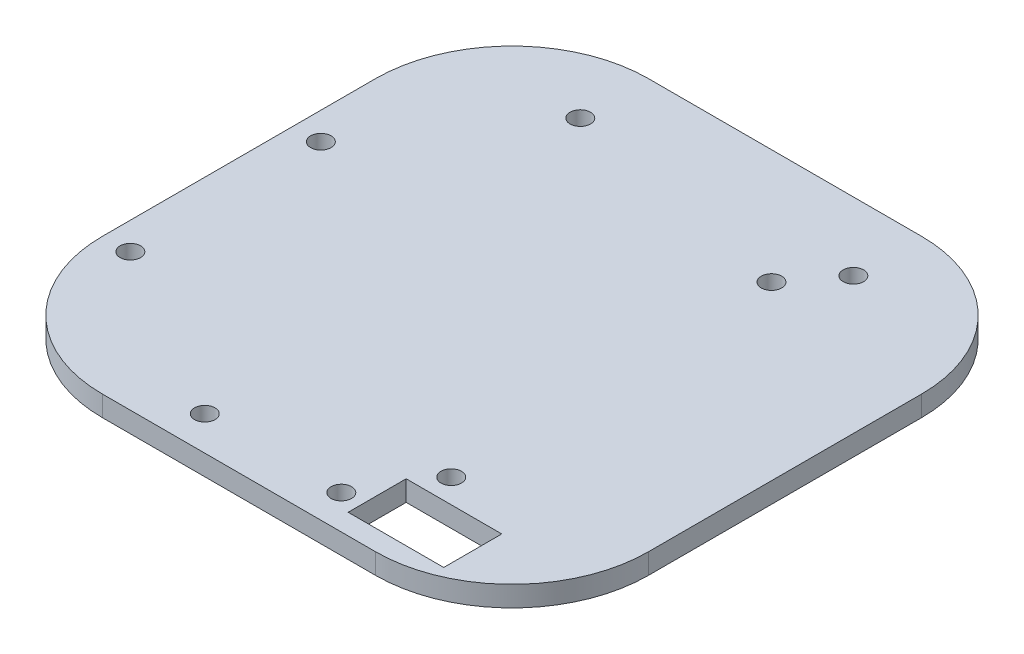
ISO-10303-21;
HEADER;
FILE_DESCRIPTION(('STEP AP214'),'2;1');
FILE_NAME('part.step','',(''),(''),'','','');
FILE_SCHEMA(('AUTOMOTIVE_DESIGN { 1 0 10303 214 1 1 1 1 }'));
ENDSEC;
DATA;
#1=APPLICATION_CONTEXT('core data for automotive mechanical design processes');
#2=APPLICATION_PROTOCOL_DEFINITION('international standard','automotive_design',2000,#1);
#3=PRODUCT_CONTEXT('',#1,'mechanical');
#4=PRODUCT('Part','Part','',(#3));
#5=PRODUCT_RELATED_PRODUCT_CATEGORY('part','',(#4));
#6=PRODUCT_DEFINITION_FORMATION('','',#4);
#7=PRODUCT_DEFINITION_CONTEXT('part definition',#1,'design');
#8=PRODUCT_DEFINITION('design','',#6,#7);
#9=PRODUCT_DEFINITION_SHAPE('','',#8);
#10=(LENGTH_UNIT() NAMED_UNIT(*) SI_UNIT(.MILLI.,.METRE.));
#11=(NAMED_UNIT(*) PLANE_ANGLE_UNIT() SI_UNIT($,.RADIAN.));
#12=(NAMED_UNIT(*) SI_UNIT($,.STERADIAN.) SOLID_ANGLE_UNIT());
#13=UNCERTAINTY_MEASURE_WITH_UNIT(LENGTH_MEASURE(1.E-05),#10,'distance_accuracy_value','');
#14=(GEOMETRIC_REPRESENTATION_CONTEXT(3) GLOBAL_UNCERTAINTY_ASSIGNED_CONTEXT((#13)) GLOBAL_UNIT_ASSIGNED_CONTEXT((#10,
#11,#12)) REPRESENTATION_CONTEXT('',''));
#15=CARTESIAN_POINT('',(0.,0.,0.));
#16=DIRECTION('',(0.,0.,1.));
#17=DIRECTION('',(1.,0.,0.));
#18=AXIS2_PLACEMENT_3D('',#15,#16,#17);
#19=CARTESIAN_POINT('',(20.,3.,-20.));
#20=DIRECTION('',(0.,-1.,0.));
#21=DIRECTION('',(0.,0.,-1.));
#22=AXIS2_PLACEMENT_3D('',#19,#20,#21);
#23=CYLINDRICAL_SURFACE('',#22,20.);
#24=DIRECTION('',(0.,-1.,0.));
#25=VECTOR('',#24,1.);
#26=CARTESIAN_POINT('',(20.,3.,0.));
#27=LINE('',#26,#25);
#28=CARTESIAN_POINT('',(20.,3.,0.));
#29=VERTEX_POINT('',#28);
#30=CARTESIAN_POINT('',(20.,0.,0.));
#31=VERTEX_POINT('',#30);
#32=EDGE_CURVE('E241',#29,#31,#27,.T.);
#33=ORIENTED_EDGE('',*,*,#32,.F.);
#34=CARTESIAN_POINT('',(20.,3.,-20.));
#35=DIRECTION('',(0.,-1.,0.));
#36=DIRECTION('',(0.,0.,-1.));
#37=AXIS2_PLACEMENT_3D('',#34,#35,#36);
#38=CIRCLE('',#37,20.);
#39=CARTESIAN_POINT('',(0.,3.,-20.));
#40=VERTEX_POINT('',#39);
#41=EDGE_CURVE('E247',#40,#29,#38,.F.);
#42=ORIENTED_EDGE('',*,*,#41,.F.);
#43=DIRECTION('',(0.,-1.,0.));
#44=VECTOR('',#43,1.);
#45=CARTESIAN_POINT('',(0.,3.,-20.));
#46=LINE('',#45,#44);
#47=CARTESIAN_POINT('',(0.,0.,-20.));
#48=VERTEX_POINT('',#47);
#49=EDGE_CURVE('E244',#48,#40,#46,.F.);
#50=ORIENTED_EDGE('',*,*,#49,.F.);
#51=CARTESIAN_POINT('',(20.,0.,-20.));
#52=DIRECTION('',(0.,-1.,0.));
#53=DIRECTION('',(0.,0.,-1.));
#54=AXIS2_PLACEMENT_3D('',#51,#52,#53);
#55=CIRCLE('',#54,20.);
#56=EDGE_CURVE('E249',#31,#48,#55,.T.);
#57=ORIENTED_EDGE('',*,*,#56,.F.);
#58=EDGE_LOOP('',(#33,#42,#50,#57));
#59=FACE_BOUND('',#58,.T.);
#60=ADVANCED_FACE('F35',(#59),#23,.T.);
#61=CARTESIAN_POINT('',(60.,3.,-20.));
#62=DIRECTION('',(0.,-1.,0.));
#63=DIRECTION('',(0.,0.,-1.));
#64=AXIS2_PLACEMENT_3D('',#61,#62,#63);
#65=CYLINDRICAL_SURFACE('',#64,20.);
#66=DIRECTION('',(0.,-1.,0.));
#67=VECTOR('',#66,1.);
#68=CARTESIAN_POINT('',(80.,3.,-20.));
#69=LINE('',#68,#67);
#70=CARTESIAN_POINT('',(80.,3.,-20.));
#71=VERTEX_POINT('',#70);
#72=CARTESIAN_POINT('',(80.,0.,-20.));
#73=VERTEX_POINT('',#72);
#74=EDGE_CURVE('E230',#71,#73,#69,.T.);
#75=ORIENTED_EDGE('',*,*,#74,.F.);
#76=CARTESIAN_POINT('',(60.,3.,-20.));
#77=DIRECTION('',(0.,-1.,0.));
#78=DIRECTION('',(0.,0.,-1.));
#79=AXIS2_PLACEMENT_3D('',#76,#77,#78);
#80=CIRCLE('',#79,20.);
#81=CARTESIAN_POINT('',(60.,3.,0.));
#82=VERTEX_POINT('',#81);
#83=EDGE_CURVE('E236',#82,#71,#80,.F.);
#84=ORIENTED_EDGE('',*,*,#83,.F.);
#85=DIRECTION('',(0.,-1.,0.));
#86=VECTOR('',#85,1.);
#87=CARTESIAN_POINT('',(60.,3.,0.));
#88=LINE('',#87,#86);
#89=CARTESIAN_POINT('',(60.,0.,0.));
#90=VERTEX_POINT('',#89);
#91=EDGE_CURVE('E233',#90,#82,#88,.F.);
#92=ORIENTED_EDGE('',*,*,#91,.F.);
#93=CARTESIAN_POINT('',(60.,0.,-20.));
#94=DIRECTION('',(0.,-1.,0.));
#95=DIRECTION('',(0.,0.,-1.));
#96=AXIS2_PLACEMENT_3D('',#93,#94,#95);
#97=CIRCLE('',#96,20.);
#98=EDGE_CURVE('E238',#73,#90,#97,.T.);
#99=ORIENTED_EDGE('',*,*,#98,.F.);
#100=EDGE_LOOP('',(#75,#84,#92,#99));
#101=FACE_BOUND('',#100,.T.);
#102=ADVANCED_FACE('F283',(#101),#65,.T.);
#103=CARTESIAN_POINT('',(60.,3.,-60.));
#104=DIRECTION('',(0.,1.,0.));
#105=DIRECTION('',(0.,0.,1.));
#106=AXIS2_PLACEMENT_3D('',#103,#104,#105);
#107=CYLINDRICAL_SURFACE('',#106,20.);
#108=DIRECTION('',(0.,1.,0.));
#109=VECTOR('',#108,1.);
#110=CARTESIAN_POINT('',(80.,3.,-60.));
#111=LINE('',#110,#109);
#112=CARTESIAN_POINT('',(80.,0.,-60.));
#113=VERTEX_POINT('',#112);
#114=CARTESIAN_POINT('',(80.,3.,-60.));
#115=VERTEX_POINT('',#114);
#116=EDGE_CURVE('E219',#113,#115,#111,.T.);
#117=ORIENTED_EDGE('',*,*,#116,.F.);
#118=CARTESIAN_POINT('',(60.,0.,-60.));
#119=DIRECTION('',(0.,-1.,0.));
#120=DIRECTION('',(0.,0.,-1.));
#121=AXIS2_PLACEMENT_3D('',#118,#119,#120);
#122=CIRCLE('',#121,20.);
#123=CARTESIAN_POINT('',(60.,0.,-80.));
#124=VERTEX_POINT('',#123);
#125=EDGE_CURVE('E225',#124,#113,#122,.T.);
#126=ORIENTED_EDGE('',*,*,#125,.F.);
#127=DIRECTION('',(0.,1.,0.));
#128=VECTOR('',#127,1.);
#129=CARTESIAN_POINT('',(60.,3.,-80.));
#130=LINE('',#129,#128);
#131=CARTESIAN_POINT('',(60.,3.,-80.));
#132=VERTEX_POINT('',#131);
#133=EDGE_CURVE('E222',#132,#124,#130,.F.);
#134=ORIENTED_EDGE('',*,*,#133,.F.);
#135=CARTESIAN_POINT('',(60.,3.,-60.));
#136=DIRECTION('',(0.,-1.,0.));
#137=DIRECTION('',(0.,0.,-1.));
#138=AXIS2_PLACEMENT_3D('',#135,#136,#137);
#139=CIRCLE('',#138,20.);
#140=EDGE_CURVE('E228',#115,#132,#139,.F.);
#141=ORIENTED_EDGE('',*,*,#140,.F.);
#142=EDGE_LOOP('',(#117,#126,#134,#141));
#143=FACE_BOUND('',#142,.T.);
#144=ADVANCED_FACE('F288',(#143),#107,.T.);
#145=CARTESIAN_POINT('',(20.,3.,-60.));
#146=DIRECTION('',(0.,-1.,0.));
#147=DIRECTION('',(0.,0.,-1.));
#148=AXIS2_PLACEMENT_3D('',#145,#146,#147);
#149=CYLINDRICAL_SURFACE('',#148,20.);
#150=DIRECTION('',(0.,-1.,0.));
#151=VECTOR('',#150,1.);
#152=CARTESIAN_POINT('',(0.,3.,-60.));
#153=LINE('',#152,#151);
#154=CARTESIAN_POINT('',(0.,3.,-60.));
#155=VERTEX_POINT('',#154);
#156=CARTESIAN_POINT('',(0.,0.,-60.));
#157=VERTEX_POINT('',#156);
#158=EDGE_CURVE('E201',#155,#157,#153,.T.);
#159=ORIENTED_EDGE('',*,*,#158,.F.);
#160=CARTESIAN_POINT('',(20.,3.,-60.));
#161=DIRECTION('',(0.,-1.,0.));
#162=DIRECTION('',(0.,0.,-1.));
#163=AXIS2_PLACEMENT_3D('',#160,#161,#162);
#164=CIRCLE('',#163,20.);
#165=CARTESIAN_POINT('',(20.,3.,-80.));
#166=VERTEX_POINT('',#165);
#167=EDGE_CURVE('E214',#166,#155,#164,.F.);
#168=ORIENTED_EDGE('',*,*,#167,.F.);
#169=DIRECTION('',(0.,-1.,0.));
#170=VECTOR('',#169,1.);
#171=CARTESIAN_POINT('',(20.,3.,-80.));
#172=LINE('',#171,#170);
#173=CARTESIAN_POINT('',(20.,0.,-80.));
#174=VERTEX_POINT('',#173);
#175=EDGE_CURVE('E211',#174,#166,#172,.F.);
#176=ORIENTED_EDGE('',*,*,#175,.F.);
#177=CARTESIAN_POINT('',(20.,0.,-60.));
#178=DIRECTION('',(0.,-1.,0.));
#179=DIRECTION('',(0.,0.,-1.));
#180=AXIS2_PLACEMENT_3D('',#177,#178,#179);
#181=CIRCLE('',#180,20.);
#182=EDGE_CURVE('E216',#157,#174,#181,.T.);
#183=ORIENTED_EDGE('',*,*,#182,.F.);
#184=EDGE_LOOP('',(#159,#168,#176,#183));
#185=FACE_BOUND('',#184,.T.);
#186=ADVANCED_FACE('F316',(#185),#149,.T.);
#187=CARTESIAN_POINT('',(0.,3.,0.));
#188=DIRECTION('',(1.,0.,0.));
#189=DIRECTION('',(0.,0.,-1.));
#190=AXIS2_PLACEMENT_3D('',#187,#188,#189);
#191=PLANE('',#190);
#192=DIRECTION('',(0.,0.,1.));
#193=VECTOR('',#192,1.);
#194=CARTESIAN_POINT('',(0.,0.,0.));
#195=LINE('',#194,#193);
#196=EDGE_CURVE('E188',#157,#48,#195,.T.);
#197=ORIENTED_EDGE('',*,*,#196,.T.);
#198=ORIENTED_EDGE('',*,*,#49,.T.);
#199=DIRECTION('',(0.,0.,1.));
#200=VECTOR('',#199,1.);
#201=CARTESIAN_POINT('',(0.,3.,0.));
#202=LINE('',#201,#200);
#203=EDGE_CURVE('E191',#155,#40,#202,.T.);
#204=ORIENTED_EDGE('',*,*,#203,.F.);
#205=ORIENTED_EDGE('',*,*,#158,.T.);
#206=EDGE_LOOP('',(#197,#198,#204,#205));
#207=FACE_BOUND('',#206,.T.);
#208=ADVANCED_FACE('F320',(#207),#191,.F.);
#209=CARTESIAN_POINT('',(0.,3.,0.));
#210=DIRECTION('',(0.,0.,-1.));
#211=DIRECTION('',(-1.,0.,0.));
#212=AXIS2_PLACEMENT_3D('',#209,#210,#211);
#213=PLANE('',#212);
#214=DIRECTION('',(1.,0.,0.));
#215=VECTOR('',#214,1.);
#216=CARTESIAN_POINT('',(0.,3.,0.));
#217=LINE('',#216,#215);
#218=EDGE_CURVE('E194',#29,#82,#217,.T.);
#219=ORIENTED_EDGE('',*,*,#218,.F.);
#220=ORIENTED_EDGE('',*,*,#32,.T.);
#221=DIRECTION('',(1.,0.,0.));
#222=VECTOR('',#221,1.);
#223=CARTESIAN_POINT('',(0.,0.,0.));
#224=LINE('',#223,#222);
#225=EDGE_CURVE('E204',#31,#90,#224,.T.);
#226=ORIENTED_EDGE('',*,*,#225,.T.);
#227=ORIENTED_EDGE('',*,*,#91,.T.);
#228=EDGE_LOOP('',(#219,#220,#226,#227));
#229=FACE_BOUND('',#228,.T.);
#230=ADVANCED_FACE('F295',(#229),#213,.F.);
#231=CARTESIAN_POINT('',(80.,3.,0.));
#232=DIRECTION('',(-1.,0.,0.));
#233=DIRECTION('',(0.,0.,1.));
#234=AXIS2_PLACEMENT_3D('',#231,#232,#233);
#235=PLANE('',#234);
#236=DIRECTION('',(0.,0.,-1.));
#237=VECTOR('',#236,1.);
#238=CARTESIAN_POINT('',(80.,3.,0.));
#239=LINE('',#238,#237);
#240=EDGE_CURVE('E197',#71,#115,#239,.T.);
#241=ORIENTED_EDGE('',*,*,#240,.F.);
#242=ORIENTED_EDGE('',*,*,#74,.T.);
#243=DIRECTION('',(0.,0.,-1.));
#244=VECTOR('',#243,1.);
#245=CARTESIAN_POINT('',(80.,0.,0.));
#246=LINE('',#245,#244);
#247=EDGE_CURVE('E206',#73,#113,#246,.T.);
#248=ORIENTED_EDGE('',*,*,#247,.T.);
#249=ORIENTED_EDGE('',*,*,#116,.T.);
#250=EDGE_LOOP('',(#241,#242,#248,#249));
#251=FACE_BOUND('',#250,.T.);
#252=ADVANCED_FACE('F303',(#251),#235,.F.);
#253=CARTESIAN_POINT('',(0.,3.,-80.));
#254=DIRECTION('',(0.,0.,1.));
#255=DIRECTION('',(1.,0.,0.));
#256=AXIS2_PLACEMENT_3D('',#253,#254,#255);
#257=PLANE('',#256);
#258=DIRECTION('',(-1.,0.,0.));
#259=VECTOR('',#258,1.);
#260=CARTESIAN_POINT('',(0.,3.,-80.));
#261=LINE('',#260,#259);
#262=EDGE_CURVE('E199',#132,#166,#261,.T.);
#263=ORIENTED_EDGE('',*,*,#262,.F.);
#264=ORIENTED_EDGE('',*,*,#133,.T.);
#265=DIRECTION('',(-1.,0.,0.));
#266=VECTOR('',#265,1.);
#267=CARTESIAN_POINT('',(0.,0.,-80.));
#268=LINE('',#267,#266);
#269=EDGE_CURVE('E195',#124,#174,#268,.T.);
#270=ORIENTED_EDGE('',*,*,#269,.T.);
#271=ORIENTED_EDGE('',*,*,#175,.T.);
#272=EDGE_LOOP('',(#263,#264,#270,#271));
#273=FACE_BOUND('',#272,.T.);
#274=ADVANCED_FACE('F311',(#273),#257,.F.);
#275=CARTESIAN_POINT('',(0.,3.,0.));
#276=DIRECTION('',(0.,-1.,0.));
#277=DIRECTION('',(0.,0.,-1.));
#278=AXIS2_PLACEMENT_3D('',#275,#276,#277);
#279=PLANE('',#278);
#280=DIRECTION('',(1.,0.,0.));
#281=VECTOR('',#280,1.);
#282=CARTESIAN_POINT('',(53.,3.,-3.));
#283=LINE('',#282,#281);
#284=CARTESIAN_POINT('',(53.,3.,-3.));
#285=VERTEX_POINT('',#284);
#286=CARTESIAN_POINT('',(67.,3.,-3.));
#287=VERTEX_POINT('',#286);
#288=EDGE_CURVE('E134',#285,#287,#283,.T.);
#289=ORIENTED_EDGE('',*,*,#288,.F.);
#290=DIRECTION('',(0.,0.,1.));
#291=VECTOR('',#290,1.);
#292=CARTESIAN_POINT('',(53.,3.,-11.5));
#293=LINE('',#292,#291);
#294=CARTESIAN_POINT('',(53.,3.,-11.5));
#295=VERTEX_POINT('',#294);
#296=EDGE_CURVE('E49',#295,#285,#293,.T.);
#297=ORIENTED_EDGE('',*,*,#296,.F.);
#298=DIRECTION('',(-1.,0.,0.));
#299=VECTOR('',#298,1.);
#300=CARTESIAN_POINT('',(53.,3.,-11.5));
#301=LINE('',#300,#299);
#302=CARTESIAN_POINT('',(67.,3.,-11.5));
#303=VERTEX_POINT('',#302);
#304=EDGE_CURVE('E141',#303,#295,#301,.T.);
#305=ORIENTED_EDGE('',*,*,#304,.F.);
#306=DIRECTION('',(0.,0.,-1.));
#307=VECTOR('',#306,1.);
#308=CARTESIAN_POINT('',(67.,3.,-11.5));
#309=LINE('',#308,#307);
#310=EDGE_CURVE('E125',#287,#303,#309,.T.);
#311=ORIENTED_EDGE('',*,*,#310,.F.);
#312=EDGE_LOOP('',(#289,#297,#305,#311));
#313=FACE_BOUND('',#312,.T.);
#314=CARTESIAN_POINT('',(56.1,3.,-15.));
#315=DIRECTION('',(0.,1.,0.));
#316=DIRECTION('',(0.,0.,1.));
#317=AXIS2_PLACEMENT_3D('',#314,#315,#316);
#318=CIRCLE('',#317,1.5);
#319=CARTESIAN_POINT('',(56.1,3.,-13.5));
#320=VERTEX_POINT('',#319);
#321=EDGE_CURVE('E148',#320,#320,#318,.T.);
#322=ORIENTED_EDGE('',*,*,#321,.F.);
#323=EDGE_LOOP('',(#322));
#324=FACE_BOUND('',#323,.T.);
#325=CARTESIAN_POINT('',(54.8,3.,-63.2));
#326=DIRECTION('',(0.,1.,0.));
#327=DIRECTION('',(0.,0.,1.));
#328=AXIS2_PLACEMENT_3D('',#325,#326,#327);
#329=CIRCLE('',#328,1.5);
#330=CARTESIAN_POINT('',(54.8,3.,-61.7));
#331=VERTEX_POINT('',#330);
#332=EDGE_CURVE('E154',#331,#331,#329,.T.);
#333=ORIENTED_EDGE('',*,*,#332,.F.);
#334=EDGE_LOOP('',(#333));
#335=FACE_BOUND('',#334,.T.);
#336=CARTESIAN_POINT('',(4.,3.,-48.));
#337=DIRECTION('',(0.,1.,0.));
#338=DIRECTION('',(0.,0.,1.));
#339=AXIS2_PLACEMENT_3D('',#336,#337,#338);
#340=CIRCLE('',#339,1.5);
#341=CARTESIAN_POINT('',(4.,3.,-46.5));
#342=VERTEX_POINT('',#341);
#343=EDGE_CURVE('E158',#342,#342,#340,.T.);
#344=ORIENTED_EDGE('',*,*,#343,.F.);
#345=EDGE_LOOP('',(#344));
#346=FACE_BOUND('',#345,.T.);
#347=CARTESIAN_POINT('',(4.,3.,-20.1));
#348=DIRECTION('',(0.,1.,0.));
#349=DIRECTION('',(0.,0.,1.));
#350=AXIS2_PLACEMENT_3D('',#347,#348,#349);
#351=CIRCLE('',#350,1.5);
#352=CARTESIAN_POINT('',(4.,3.,-18.6));
#353=VERTEX_POINT('',#352);
#354=EDGE_CURVE('E162',#353,#353,#351,.T.);
#355=ORIENTED_EDGE('',*,*,#354,.F.);
#356=EDGE_LOOP('',(#355));
#357=FACE_BOUND('',#356,.T.);
#358=CARTESIAN_POINT('',(60.,3.,-70.));
#359=DIRECTION('',(0.,1.,0.));
#360=DIRECTION('',(0.,0.,1.));
#361=AXIS2_PLACEMENT_3D('',#358,#359,#360);
#362=CIRCLE('',#361,1.5);
#363=CARTESIAN_POINT('',(60.,3.,-68.5));
#364=VERTEX_POINT('',#363);
#365=EDGE_CURVE('E170',#364,#364,#362,.T.);
#366=ORIENTED_EDGE('',*,*,#365,.F.);
#367=EDGE_LOOP('',(#366));
#368=FACE_BOUND('',#367,.T.);
#369=CARTESIAN_POINT('',(20.,3.,-70.));
#370=DIRECTION('',(0.,1.,0.));
#371=DIRECTION('',(0.,0.,1.));
#372=AXIS2_PLACEMENT_3D('',#369,#370,#371);
#373=CIRCLE('',#372,1.5);
#374=CARTESIAN_POINT('',(20.,3.,-68.5));
#375=VERTEX_POINT('',#374);
#376=EDGE_CURVE('E169',#375,#375,#373,.T.);
#377=ORIENTED_EDGE('',*,*,#376,.F.);
#378=EDGE_LOOP('',(#377));
#379=FACE_BOUND('',#378,.T.);
#380=CARTESIAN_POINT('',(50.,3.,-5.));
#381=DIRECTION('',(0.,1.,0.));
#382=DIRECTION('',(0.,0.,1.));
#383=AXIS2_PLACEMENT_3D('',#380,#381,#382);
#384=CIRCLE('',#383,1.5);
#385=CARTESIAN_POINT('',(50.,3.,-3.5));
#386=VERTEX_POINT('',#385);
#387=EDGE_CURVE('E176',#386,#386,#384,.T.);
#388=ORIENTED_EDGE('',*,*,#387,.F.);
#389=EDGE_LOOP('',(#388));
#390=FACE_BOUND('',#389,.T.);
#391=CARTESIAN_POINT('',(30.,3.,-5.));
#392=DIRECTION('',(0.,1.,0.));
#393=DIRECTION('',(0.,0.,1.));
#394=AXIS2_PLACEMENT_3D('',#391,#392,#393);
#395=CIRCLE('',#394,1.5);
#396=CARTESIAN_POINT('',(30.,3.,-3.49999999999999));
#397=VERTEX_POINT('',#396);
#398=EDGE_CURVE('E182',#397,#397,#395,.T.);
#399=ORIENTED_EDGE('',*,*,#398,.F.);
#400=EDGE_LOOP('',(#399));
#401=FACE_BOUND('',#400,.T.);
#402=ORIENTED_EDGE('',*,*,#203,.T.);
#403=ORIENTED_EDGE('',*,*,#41,.T.);
#404=ORIENTED_EDGE('',*,*,#218,.T.);
#405=ORIENTED_EDGE('',*,*,#83,.T.);
#406=ORIENTED_EDGE('',*,*,#240,.T.);
#407=ORIENTED_EDGE('',*,*,#140,.T.);
#408=ORIENTED_EDGE('',*,*,#262,.T.);
#409=ORIENTED_EDGE('',*,*,#167,.T.);
#410=EDGE_LOOP('',(#402,#403,#404,#405,#406,#407,#408,#409));
#411=FACE_BOUND('',#410,.T.);
#412=ADVANCED_FACE('F138',(#313,#324,#335,#346,#357,#368,#379,#390,#401,#411),#279,.F.);
#413=CARTESIAN_POINT('',(0.,0.,0.));
#414=DIRECTION('',(0.,-1.,0.));
#415=DIRECTION('',(0.,0.,-1.));
#416=AXIS2_PLACEMENT_3D('',#413,#414,#415);
#417=PLANE('',#416);
#418=DIRECTION('',(0.,0.,-1.));
#419=VECTOR('',#418,1.);
#420=CARTESIAN_POINT('',(53.,0.,0.));
#421=LINE('',#420,#419);
#422=CARTESIAN_POINT('',(53.,0.,-3.));
#423=VERTEX_POINT('',#422);
#424=CARTESIAN_POINT('',(53.,0.,-11.5));
#425=VERTEX_POINT('',#424);
#426=EDGE_CURVE('E11',#423,#425,#421,.T.);
#427=ORIENTED_EDGE('',*,*,#426,.F.);
#428=DIRECTION('',(-1.,0.,0.));
#429=VECTOR('',#428,1.);
#430=CARTESIAN_POINT('',(0.,0.,-3.));
#431=LINE('',#430,#429);
#432=CARTESIAN_POINT('',(67.,0.,-3.));
#433=VERTEX_POINT('',#432);
#434=EDGE_CURVE('E251',#433,#423,#431,.T.);
#435=ORIENTED_EDGE('',*,*,#434,.F.);
#436=DIRECTION('',(0.,0.,1.));
#437=VECTOR('',#436,1.);
#438=CARTESIAN_POINT('',(67.,0.,0.));
#439=LINE('',#438,#437);
#440=CARTESIAN_POINT('',(67.,0.,-11.5));
#441=VERTEX_POINT('',#440);
#442=EDGE_CURVE('E128',#441,#433,#439,.T.);
#443=ORIENTED_EDGE('',*,*,#442,.F.);
#444=DIRECTION('',(1.,0.,0.));
#445=VECTOR('',#444,1.);
#446=CARTESIAN_POINT('',(0.,0.,-11.5));
#447=LINE('',#446,#445);
#448=EDGE_CURVE('E42',#425,#441,#447,.T.);
#449=ORIENTED_EDGE('',*,*,#448,.F.);
#450=EDGE_LOOP('',(#427,#435,#443,#449));
#451=FACE_BOUND('',#450,.T.);
#452=CARTESIAN_POINT('',(56.1,0.,-15.));
#453=DIRECTION('',(0.,-1.,0.));
#454=DIRECTION('',(0.,0.,-1.));
#455=AXIS2_PLACEMENT_3D('',#452,#453,#454);
#456=CIRCLE('',#455,1.5);
#457=CARTESIAN_POINT('',(56.1,0.,-16.5));
#458=VERTEX_POINT('',#457);
#459=EDGE_CURVE('E153',#458,#458,#456,.T.);
#460=ORIENTED_EDGE('',*,*,#459,.F.);
#461=EDGE_LOOP('',(#460));
#462=FACE_BOUND('',#461,.T.);
#463=CARTESIAN_POINT('',(54.8,0.,-63.2));
#464=DIRECTION('',(0.,-1.,0.));
#465=DIRECTION('',(0.,0.,-1.));
#466=AXIS2_PLACEMENT_3D('',#463,#464,#465);
#467=CIRCLE('',#466,1.5);
#468=CARTESIAN_POINT('',(54.8,0.,-64.7));
#469=VERTEX_POINT('',#468);
#470=EDGE_CURVE('E157',#469,#469,#467,.T.);
#471=ORIENTED_EDGE('',*,*,#470,.F.);
#472=EDGE_LOOP('',(#471));
#473=FACE_BOUND('',#472,.T.);
#474=CARTESIAN_POINT('',(4.,0.,-48.));
#475=DIRECTION('',(0.,-1.,0.));
#476=DIRECTION('',(0.,0.,-1.));
#477=AXIS2_PLACEMENT_3D('',#474,#475,#476);
#478=CIRCLE('',#477,1.5);
#479=CARTESIAN_POINT('',(4.,0.,-49.5));
#480=VERTEX_POINT('',#479);
#481=EDGE_CURVE('E161',#480,#480,#478,.T.);
#482=ORIENTED_EDGE('',*,*,#481,.F.);
#483=EDGE_LOOP('',(#482));
#484=FACE_BOUND('',#483,.T.);
#485=CARTESIAN_POINT('',(4.,0.,-20.1));
#486=DIRECTION('',(0.,-1.,0.));
#487=DIRECTION('',(0.,0.,-1.));
#488=AXIS2_PLACEMENT_3D('',#485,#486,#487);
#489=CIRCLE('',#488,1.5);
#490=CARTESIAN_POINT('',(4.,0.,-21.6));
#491=VERTEX_POINT('',#490);
#492=EDGE_CURVE('E165',#491,#491,#489,.T.);
#493=ORIENTED_EDGE('',*,*,#492,.F.);
#494=EDGE_LOOP('',(#493));
#495=FACE_BOUND('',#494,.T.);
#496=CARTESIAN_POINT('',(60.,0.,-70.));
#497=DIRECTION('',(0.,1.,0.));
#498=DIRECTION('',(0.,0.,1.));
#499=AXIS2_PLACEMENT_3D('',#496,#497,#498);
#500=CIRCLE('',#499,1.5);
#501=CARTESIAN_POINT('',(60.,0.,-68.5));
#502=VERTEX_POINT('',#501);
#503=EDGE_CURVE('E166',#502,#502,#500,.T.);
#504=ORIENTED_EDGE('',*,*,#503,.T.);
#505=EDGE_LOOP('',(#504));
#506=FACE_BOUND('',#505,.T.);
#507=CARTESIAN_POINT('',(20.,0.,-70.));
#508=DIRECTION('',(0.,1.,0.));
#509=DIRECTION('',(0.,0.,1.));
#510=AXIS2_PLACEMENT_3D('',#507,#508,#509);
#511=CIRCLE('',#510,1.5);
#512=CARTESIAN_POINT('',(20.,0.,-68.5));
#513=VERTEX_POINT('',#512);
#514=EDGE_CURVE('E173',#513,#513,#511,.T.);
#515=ORIENTED_EDGE('',*,*,#514,.T.);
#516=EDGE_LOOP('',(#515));
#517=FACE_BOUND('',#516,.T.);
#518=CARTESIAN_POINT('',(50.,0.,-5.));
#519=DIRECTION('',(0.,1.,0.));
#520=DIRECTION('',(0.,0.,1.));
#521=AXIS2_PLACEMENT_3D('',#518,#519,#520);
#522=CIRCLE('',#521,1.5);
#523=CARTESIAN_POINT('',(50.,0.,-3.5));
#524=VERTEX_POINT('',#523);
#525=EDGE_CURVE('E179',#524,#524,#522,.T.);
#526=ORIENTED_EDGE('',*,*,#525,.T.);
#527=EDGE_LOOP('',(#526));
#528=FACE_BOUND('',#527,.T.);
#529=CARTESIAN_POINT('',(30.,0.,-5.));
#530=DIRECTION('',(0.,1.,0.));
#531=DIRECTION('',(0.,0.,1.));
#532=AXIS2_PLACEMENT_3D('',#529,#530,#531);
#533=CIRCLE('',#532,1.5);
#534=CARTESIAN_POINT('',(30.,0.,-3.49999999999999));
#535=VERTEX_POINT('',#534);
#536=EDGE_CURVE('E185',#535,#535,#533,.T.);
#537=ORIENTED_EDGE('',*,*,#536,.T.);
#538=EDGE_LOOP('',(#537));
#539=FACE_BOUND('',#538,.T.);
#540=ORIENTED_EDGE('',*,*,#225,.F.);
#541=ORIENTED_EDGE('',*,*,#56,.T.);
#542=ORIENTED_EDGE('',*,*,#196,.F.);
#543=ORIENTED_EDGE('',*,*,#182,.T.);
#544=ORIENTED_EDGE('',*,*,#269,.F.);
#545=ORIENTED_EDGE('',*,*,#125,.T.);
#546=ORIENTED_EDGE('',*,*,#247,.F.);
#547=ORIENTED_EDGE('',*,*,#98,.T.);
#548=EDGE_LOOP('',(#540,#541,#542,#543,#544,#545,#546,#547));
#549=FACE_BOUND('',#548,.T.);
#550=ADVANCED_FACE('F267',(#451,#462,#473,#484,#495,#506,#517,#528,#539,#549),#417,.T.);
#551=CARTESIAN_POINT('',(30.,0.,-5.));
#552=DIRECTION('',(0.,1.,0.));
#553=DIRECTION('',(0.,0.,1.));
#554=AXIS2_PLACEMENT_3D('',#551,#552,#553);
#555=CYLINDRICAL_SURFACE('',#554,1.5);
#556=ORIENTED_EDGE('',*,*,#536,.F.);
#557=EDGE_LOOP('',(#556));
#558=FACE_BOUND('',#557,.T.);
#559=ORIENTED_EDGE('',*,*,#398,.T.);
#560=EDGE_LOOP('',(#559));
#561=FACE_BOUND('',#560,.T.);
#562=ADVANCED_FACE('F323',(#558,#561),#555,.F.);
#563=CARTESIAN_POINT('',(50.,0.,-5.));
#564=DIRECTION('',(0.,1.,0.));
#565=DIRECTION('',(0.,0.,1.));
#566=AXIS2_PLACEMENT_3D('',#563,#564,#565);
#567=CYLINDRICAL_SURFACE('',#566,1.5);
#568=ORIENTED_EDGE('',*,*,#525,.F.);
#569=EDGE_LOOP('',(#568));
#570=FACE_BOUND('',#569,.T.);
#571=ORIENTED_EDGE('',*,*,#387,.T.);
#572=EDGE_LOOP('',(#571));
#573=FACE_BOUND('',#572,.T.);
#574=ADVANCED_FACE('F329',(#570,#573),#567,.F.);
#575=CARTESIAN_POINT('',(20.,0.,-70.));
#576=DIRECTION('',(0.,1.,0.));
#577=DIRECTION('',(0.,0.,1.));
#578=AXIS2_PLACEMENT_3D('',#575,#576,#577);
#579=CYLINDRICAL_SURFACE('',#578,1.5);
#580=ORIENTED_EDGE('',*,*,#514,.F.);
#581=EDGE_LOOP('',(#580));
#582=FACE_BOUND('',#581,.T.);
#583=ORIENTED_EDGE('',*,*,#376,.T.);
#584=EDGE_LOOP('',(#583));
#585=FACE_BOUND('',#584,.T.);
#586=ADVANCED_FACE('F390',(#582,#585),#579,.F.);
#587=CARTESIAN_POINT('',(60.,0.,-70.));
#588=DIRECTION('',(0.,1.,0.));
#589=DIRECTION('',(0.,0.,1.));
#590=AXIS2_PLACEMENT_3D('',#587,#588,#589);
#591=CYLINDRICAL_SURFACE('',#590,1.5);
#592=ORIENTED_EDGE('',*,*,#503,.F.);
#593=EDGE_LOOP('',(#592));
#594=FACE_BOUND('',#593,.T.);
#595=ORIENTED_EDGE('',*,*,#365,.T.);
#596=EDGE_LOOP('',(#595));
#597=FACE_BOUND('',#596,.T.);
#598=ADVANCED_FACE('F398',(#594,#597),#591,.F.);
#599=CARTESIAN_POINT('',(4.,-7.,-20.1));
#600=DIRECTION('',(0.,1.,0.));
#601=DIRECTION('',(0.,0.,1.));
#602=AXIS2_PLACEMENT_3D('',#599,#600,#601);
#603=CYLINDRICAL_SURFACE('',#602,1.5);
#604=ORIENTED_EDGE('',*,*,#492,.T.);
#605=EDGE_LOOP('',(#604));
#606=FACE_BOUND('',#605,.T.);
#607=ORIENTED_EDGE('',*,*,#354,.T.);
#608=EDGE_LOOP('',(#607));
#609=FACE_BOUND('',#608,.T.);
#610=ADVANCED_FACE('F406',(#606,#609),#603,.F.);
#611=CARTESIAN_POINT('',(4.,-7.,-48.));
#612=DIRECTION('',(0.,1.,0.));
#613=DIRECTION('',(0.,0.,1.));
#614=AXIS2_PLACEMENT_3D('',#611,#612,#613);
#615=CYLINDRICAL_SURFACE('',#614,1.5);
#616=ORIENTED_EDGE('',*,*,#481,.T.);
#617=EDGE_LOOP('',(#616));
#618=FACE_BOUND('',#617,.T.);
#619=ORIENTED_EDGE('',*,*,#343,.T.);
#620=EDGE_LOOP('',(#619));
#621=FACE_BOUND('',#620,.T.);
#622=ADVANCED_FACE('F414',(#618,#621),#615,.F.);
#623=CARTESIAN_POINT('',(54.8,-7.,-63.2));
#624=DIRECTION('',(0.,1.,0.));
#625=DIRECTION('',(0.,0.,1.));
#626=AXIS2_PLACEMENT_3D('',#623,#624,#625);
#627=CYLINDRICAL_SURFACE('',#626,1.5);
#628=ORIENTED_EDGE('',*,*,#470,.T.);
#629=EDGE_LOOP('',(#628));
#630=FACE_BOUND('',#629,.T.);
#631=ORIENTED_EDGE('',*,*,#332,.T.);
#632=EDGE_LOOP('',(#631));
#633=FACE_BOUND('',#632,.T.);
#634=ADVANCED_FACE('F278',(#630,#633),#627,.F.);
#635=CARTESIAN_POINT('',(56.1,-7.,-15.));
#636=DIRECTION('',(0.,1.,0.));
#637=DIRECTION('',(0.,0.,1.));
#638=AXIS2_PLACEMENT_3D('',#635,#636,#637);
#639=CYLINDRICAL_SURFACE('',#638,1.5);
#640=ORIENTED_EDGE('',*,*,#459,.T.);
#641=EDGE_LOOP('',(#640));
#642=FACE_BOUND('',#641,.T.);
#643=ORIENTED_EDGE('',*,*,#321,.T.);
#644=EDGE_LOOP('',(#643));
#645=FACE_BOUND('',#644,.T.);
#646=ADVANCED_FACE('F271',(#642,#645),#639,.F.);
#647=CARTESIAN_POINT('',(53.,-7.,-11.5));
#648=DIRECTION('',(-1.,0.,0.));
#649=DIRECTION('',(0.,0.,1.));
#650=AXIS2_PLACEMENT_3D('',#647,#648,#649);
#651=PLANE('',#650);
#652=ORIENTED_EDGE('',*,*,#426,.T.);
#653=DIRECTION('',(0.,1.,0.));
#654=VECTOR('',#653,1.);
#655=CARTESIAN_POINT('',(53.,-7.,-11.5));
#656=LINE('',#655,#654);
#657=EDGE_CURVE('E146',#425,#295,#656,.T.);
#658=ORIENTED_EDGE('',*,*,#657,.T.);
#659=ORIENTED_EDGE('',*,*,#296,.T.);
#660=DIRECTION('',(0.,1.,0.));
#661=VECTOR('',#660,1.);
#662=CARTESIAN_POINT('',(53.,-7.,-3.));
#663=LINE('',#662,#661);
#664=EDGE_CURVE('E131',#423,#285,#663,.T.);
#665=ORIENTED_EDGE('',*,*,#664,.F.);
#666=EDGE_LOOP('',(#652,#658,#659,#665));
#667=FACE_BOUND('',#666,.T.);
#668=ADVANCED_FACE('F269',(#667),#651,.F.);
#669=CARTESIAN_POINT('',(53.,-7.,-11.5));
#670=DIRECTION('',(0.,0.,-1.));
#671=DIRECTION('',(-1.,0.,0.));
#672=AXIS2_PLACEMENT_3D('',#669,#670,#671);
#673=PLANE('',#672);
#674=ORIENTED_EDGE('',*,*,#448,.T.);
#675=DIRECTION('',(0.,1.,0.));
#676=VECTOR('',#675,1.);
#677=CARTESIAN_POINT('',(67.,-7.,-11.5));
#678=LINE('',#677,#676);
#679=EDGE_CURVE('E130',#441,#303,#678,.T.);
#680=ORIENTED_EDGE('',*,*,#679,.T.);
#681=ORIENTED_EDGE('',*,*,#304,.T.);
#682=ORIENTED_EDGE('',*,*,#657,.F.);
#683=EDGE_LOOP('',(#674,#680,#681,#682));
#684=FACE_BOUND('',#683,.T.);
#685=ADVANCED_FACE('F264',(#684),#673,.F.);
#686=CARTESIAN_POINT('',(67.,-7.,-11.5));
#687=DIRECTION('',(1.,0.,0.));
#688=DIRECTION('',(0.,0.,-1.));
#689=AXIS2_PLACEMENT_3D('',#686,#687,#688);
#690=PLANE('',#689);
#691=ORIENTED_EDGE('',*,*,#442,.T.);
#692=DIRECTION('',(0.,1.,0.));
#693=VECTOR('',#692,1.);
#694=CARTESIAN_POINT('',(67.,-7.,-3.));
#695=LINE('',#694,#693);
#696=EDGE_CURVE('E57',#433,#287,#695,.T.);
#697=ORIENTED_EDGE('',*,*,#696,.T.);
#698=ORIENTED_EDGE('',*,*,#310,.T.);
#699=ORIENTED_EDGE('',*,*,#679,.F.);
#700=EDGE_LOOP('',(#691,#697,#698,#699));
#701=FACE_BOUND('',#700,.T.);
#702=ADVANCED_FACE('F122',(#701),#690,.F.);
#703=CARTESIAN_POINT('',(53.,-7.,-3.));
#704=DIRECTION('',(0.,0.,1.));
#705=DIRECTION('',(1.,0.,0.));
#706=AXIS2_PLACEMENT_3D('',#703,#704,#705);
#707=PLANE('',#706);
#708=ORIENTED_EDGE('',*,*,#434,.T.);
#709=ORIENTED_EDGE('',*,*,#664,.T.);
#710=ORIENTED_EDGE('',*,*,#288,.T.);
#711=ORIENTED_EDGE('',*,*,#696,.F.);
#712=EDGE_LOOP('',(#708,#709,#710,#711));
#713=FACE_BOUND('',#712,.T.);
#714=ADVANCED_FACE('F135',(#713),#707,.F.);
#715=CLOSED_SHELL('',(#60,#102,#144,#186,#208,#230,#252,#274,#412,#550,#562,#574,#586,#598,#610,
#622,#634,#646,#668,#685,#702,#714));
#716=MANIFOLD_SOLID_BREP('B2',#715);
#717=ADVANCED_BREP_SHAPE_REPRESENTATION('',(#18,#716),#14);
#718=SHAPE_DEFINITION_REPRESENTATION(#9,#717);
ENDSEC;
END-ISO-10303-21;
